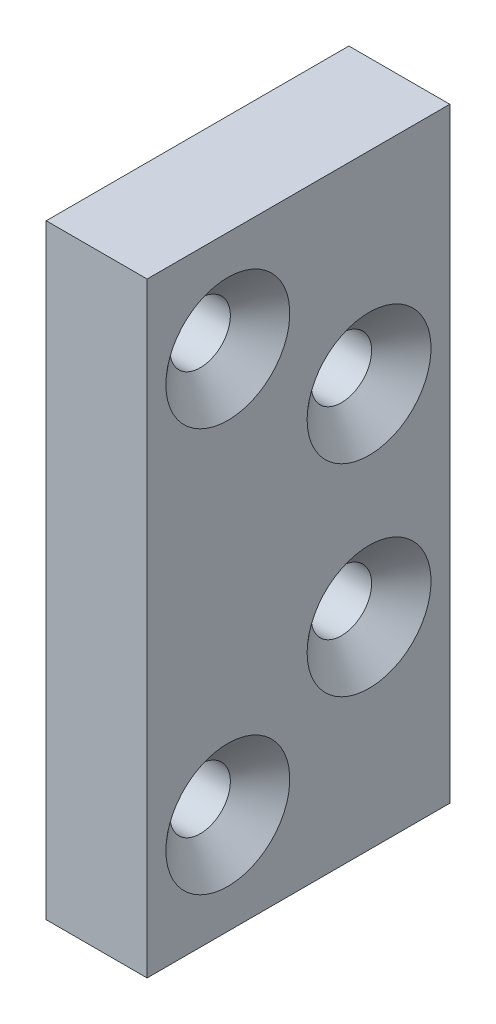
ISO-10303-21;
HEADER;
FILE_DESCRIPTION(('STEP AP214'),'2;1');
FILE_NAME('part.step','',(''),(''),'','','');
FILE_SCHEMA(('AUTOMOTIVE_DESIGN { 1 0 10303 214 1 1 1 1 }'));
ENDSEC;
DATA;
#1=APPLICATION_CONTEXT('core data for automotive mechanical design processes');
#2=APPLICATION_PROTOCOL_DEFINITION('international standard','automotive_design',2000,#1);
#3=PRODUCT_CONTEXT('',#1,'mechanical');
#4=PRODUCT('Part','Part','',(#3));
#5=PRODUCT_RELATED_PRODUCT_CATEGORY('part','',(#4));
#6=PRODUCT_DEFINITION_FORMATION('','',#4);
#7=PRODUCT_DEFINITION_CONTEXT('part definition',#1,'design');
#8=PRODUCT_DEFINITION('design','',#6,#7);
#9=PRODUCT_DEFINITION_SHAPE('','',#8);
#10=(LENGTH_UNIT() NAMED_UNIT(*) SI_UNIT(.MILLI.,.METRE.));
#11=(NAMED_UNIT(*) PLANE_ANGLE_UNIT() SI_UNIT($,.RADIAN.));
#12=(NAMED_UNIT(*) SI_UNIT($,.STERADIAN.) SOLID_ANGLE_UNIT());
#13=UNCERTAINTY_MEASURE_WITH_UNIT(LENGTH_MEASURE(1.E-05),#10,'distance_accuracy_value','');
#14=(GEOMETRIC_REPRESENTATION_CONTEXT(3) GLOBAL_UNCERTAINTY_ASSIGNED_CONTEXT((#13)) GLOBAL_UNIT_ASSIGNED_CONTEXT((#10,
#11,#12)) REPRESENTATION_CONTEXT('',''));
#15=CARTESIAN_POINT('',(0.,0.,0.));
#16=DIRECTION('',(0.,0.,1.));
#17=DIRECTION('',(1.,0.,0.));
#18=AXIS2_PLACEMENT_3D('',#15,#16,#17);
#19=CARTESIAN_POINT('',(6.35,19.05,-9.52499999999999));
#20=DIRECTION('',(-1.,0.,0.));
#21=DIRECTION('',(0.,0.,1.));
#22=AXIS2_PLACEMENT_3D('',#19,#20,#21);
#23=PLANE('',#22);
#24=CARTESIAN_POINT('',(6.35,-6.35,-4.445));
#25=DIRECTION('',(-1.,0.,0.));
#26=DIRECTION('',(0.,0.,1.));
#27=AXIS2_PLACEMENT_3D('',#24,#25,#26);
#28=CIRCLE('',#27,3.89890000000001);
#29=CARTESIAN_POINT('',(6.35,-6.35,-0.546099999999985));
#30=VERTEX_POINT('',#29);
#31=EDGE_CURVE('E121',#30,#30,#28,.T.);
#32=ORIENTED_EDGE('',*,*,#31,.T.);
#33=EDGE_LOOP('',(#32));
#34=FACE_BOUND('',#33,.T.);
#35=CARTESIAN_POINT('',(6.35,-12.7,4.44500000000001));
#36=DIRECTION('',(-1.,0.,0.));
#37=DIRECTION('',(0.,0.,1.));
#38=AXIS2_PLACEMENT_3D('',#35,#36,#37);
#39=CIRCLE('',#38,3.89890000000001);
#40=CARTESIAN_POINT('',(6.35,-12.7,8.34390000000002));
#41=VERTEX_POINT('',#40);
#42=EDGE_CURVE('E118',#41,#41,#39,.T.);
#43=ORIENTED_EDGE('',*,*,#42,.T.);
#44=EDGE_LOOP('',(#43));
#45=FACE_BOUND('',#44,.T.);
#46=CARTESIAN_POINT('',(6.35,6.35,-4.445));
#47=DIRECTION('',(-1.,0.,0.));
#48=DIRECTION('',(0.,0.,1.));
#49=AXIS2_PLACEMENT_3D('',#46,#47,#48);
#50=CIRCLE('',#49,3.89890000000002);
#51=CARTESIAN_POINT('',(6.35,6.35,-0.546099999999978));
#52=VERTEX_POINT('',#51);
#53=EDGE_CURVE('E115',#52,#52,#50,.T.);
#54=ORIENTED_EDGE('',*,*,#53,.T.);
#55=EDGE_LOOP('',(#54));
#56=FACE_BOUND('',#55,.T.);
#57=CARTESIAN_POINT('',(6.35,12.7,4.44500000000001));
#58=DIRECTION('',(-1.,0.,0.));
#59=DIRECTION('',(0.,0.,1.));
#60=AXIS2_PLACEMENT_3D('',#57,#58,#59);
#61=CIRCLE('',#60,3.89890000000002);
#62=CARTESIAN_POINT('',(6.35,12.7,8.34390000000002));
#63=VERTEX_POINT('',#62);
#64=EDGE_CURVE('E112',#63,#63,#61,.T.);
#65=ORIENTED_EDGE('',*,*,#64,.T.);
#66=EDGE_LOOP('',(#65));
#67=FACE_BOUND('',#66,.T.);
#68=DIRECTION('',(0.,1.,0.));
#69=VECTOR('',#68,1.);
#70=CARTESIAN_POINT('',(6.35,-19.05,-9.525));
#71=LINE('',#70,#69);
#72=CARTESIAN_POINT('',(6.35,-19.05,-9.525));
#73=VERTEX_POINT('',#72);
#74=CARTESIAN_POINT('',(6.35,19.05,-9.525));
#75=VERTEX_POINT('',#74);
#76=EDGE_CURVE('E84',#73,#75,#71,.T.);
#77=ORIENTED_EDGE('',*,*,#76,.T.);
#78=DIRECTION('',(0.,0.,1.));
#79=VECTOR('',#78,1.);
#80=CARTESIAN_POINT('',(6.35,19.05,9.525));
#81=LINE('',#80,#79);
#82=CARTESIAN_POINT('',(6.35,19.05,9.525));
#83=VERTEX_POINT('',#82);
#84=EDGE_CURVE('E80',#75,#83,#81,.T.);
#85=ORIENTED_EDGE('',*,*,#84,.T.);
#86=DIRECTION('',(0.,-1.,0.));
#87=VECTOR('',#86,1.);
#88=CARTESIAN_POINT('',(6.35,-19.05,9.525));
#89=LINE('',#88,#87);
#90=CARTESIAN_POINT('',(6.35,-19.05,9.525));
#91=VERTEX_POINT('',#90);
#92=EDGE_CURVE('E82',#83,#91,#89,.T.);
#93=ORIENTED_EDGE('',*,*,#92,.T.);
#94=DIRECTION('',(0.,0.,-1.));
#95=VECTOR('',#94,1.);
#96=CARTESIAN_POINT('',(6.35,-19.05,9.525));
#97=LINE('',#96,#95);
#98=EDGE_CURVE('E49',#91,#73,#97,.T.);
#99=ORIENTED_EDGE('',*,*,#98,.T.);
#100=EDGE_LOOP('',(#77,#85,#93,#99));
#101=FACE_BOUND('',#100,.T.);
#102=ADVANCED_FACE('F32',(#34,#45,#56,#67,#101),#23,.F.);
#103=CARTESIAN_POINT('',(0.,19.05,-9.52499999999999));
#104=DIRECTION('',(-1.,0.,0.));
#105=DIRECTION('',(0.,0.,1.));
#106=AXIS2_PLACEMENT_3D('',#103,#104,#105);
#107=PLANE('',#106);
#108=CARTESIAN_POINT('',(0.,-12.7,4.44500000000001));
#109=DIRECTION('',(1.,0.,0.));
#110=DIRECTION('',(0.,0.,1.));
#111=AXIS2_PLACEMENT_3D('',#108,#109,#110);
#112=CIRCLE('',#111,1.89865);
#113=CARTESIAN_POINT('',(0.,-12.7,6.34365000000001));
#114=VERTEX_POINT('',#113);
#115=EDGE_CURVE('E187',#114,#114,#112,.T.);
#116=ORIENTED_EDGE('',*,*,#115,.T.);
#117=EDGE_LOOP('',(#116));
#118=FACE_BOUND('',#117,.T.);
#119=CARTESIAN_POINT('',(0.,12.7,4.44500000000001));
#120=DIRECTION('',(1.,0.,0.));
#121=DIRECTION('',(0.,0.,-1.));
#122=AXIS2_PLACEMENT_3D('',#119,#120,#121);
#123=CIRCLE('',#122,1.89865);
#124=CARTESIAN_POINT('',(0.,12.7,2.54635000000001));
#125=VERTEX_POINT('',#124);
#126=EDGE_CURVE('E102',#125,#125,#123,.T.);
#127=ORIENTED_EDGE('',*,*,#126,.T.);
#128=EDGE_LOOP('',(#127));
#129=FACE_BOUND('',#128,.T.);
#130=DIRECTION('',(0.,1.,0.));
#131=VECTOR('',#130,1.);
#132=CARTESIAN_POINT('',(0.,-19.05,-9.525));
#133=LINE('',#132,#131);
#134=CARTESIAN_POINT('',(0.,-19.05,-9.525));
#135=VERTEX_POINT('',#134);
#136=CARTESIAN_POINT('',(0.,19.05,-9.525));
#137=VERTEX_POINT('',#136);
#138=EDGE_CURVE('E99',#135,#137,#133,.T.);
#139=ORIENTED_EDGE('',*,*,#138,.F.);
#140=DIRECTION('',(0.,0.,-1.));
#141=VECTOR('',#140,1.);
#142=CARTESIAN_POINT('',(0.,-19.05,9.525));
#143=LINE('',#142,#141);
#144=CARTESIAN_POINT('',(0.,-19.05,9.525));
#145=VERTEX_POINT('',#144);
#146=EDGE_CURVE('E72',#145,#135,#143,.T.);
#147=ORIENTED_EDGE('',*,*,#146,.F.);
#148=DIRECTION('',(0.,-1.,0.));
#149=VECTOR('',#148,1.);
#150=CARTESIAN_POINT('',(0.,-19.05,9.525));
#151=LINE('',#150,#149);
#152=CARTESIAN_POINT('',(0.,19.05,9.525));
#153=VERTEX_POINT('',#152);
#154=EDGE_CURVE('E66',#153,#145,#151,.T.);
#155=ORIENTED_EDGE('',*,*,#154,.F.);
#156=DIRECTION('',(0.,0.,1.));
#157=VECTOR('',#156,1.);
#158=CARTESIAN_POINT('',(0.,19.05,9.525));
#159=LINE('',#158,#157);
#160=EDGE_CURVE('E89',#137,#153,#159,.T.);
#161=ORIENTED_EDGE('',*,*,#160,.F.);
#162=EDGE_LOOP('',(#139,#147,#155,#161));
#163=FACE_BOUND('',#162,.T.);
#164=CARTESIAN_POINT('',(0.,6.35,-4.445));
#165=DIRECTION('',(1.,0.,0.));
#166=DIRECTION('',(0.,0.,-1.));
#167=AXIS2_PLACEMENT_3D('',#164,#165,#166);
#168=CIRCLE('',#167,1.89865);
#169=CARTESIAN_POINT('',(0.,6.35,-6.34364999999999));
#170=VERTEX_POINT('',#169);
#171=EDGE_CURVE('E190',#170,#170,#168,.T.);
#172=ORIENTED_EDGE('',*,*,#171,.T.);
#173=EDGE_LOOP('',(#172));
#174=FACE_BOUND('',#173,.T.);
#175=CARTESIAN_POINT('',(0.,-6.35,-4.445));
#176=DIRECTION('',(1.,0.,0.));
#177=DIRECTION('',(0.,0.,1.));
#178=AXIS2_PLACEMENT_3D('',#175,#176,#177);
#179=CIRCLE('',#178,1.89865);
#180=CARTESIAN_POINT('',(0.,-6.35,-2.54635));
#181=VERTEX_POINT('',#180);
#182=EDGE_CURVE('E185',#181,#181,#179,.T.);
#183=ORIENTED_EDGE('',*,*,#182,.T.);
#184=EDGE_LOOP('',(#183));
#185=FACE_BOUND('',#184,.T.);
#186=ADVANCED_FACE('F146',(#118,#129,#163,#174,#185),#107,.T.);
#187=CARTESIAN_POINT('',(6.35,-19.05,-9.525));
#188=DIRECTION('',(0.,0.,1.));
#189=DIRECTION('',(1.,0.,0.));
#190=AXIS2_PLACEMENT_3D('',#187,#188,#189);
#191=PLANE('',#190);
#192=ORIENTED_EDGE('',*,*,#138,.T.);
#193=DIRECTION('',(-1.,0.,0.));
#194=VECTOR('',#193,1.);
#195=CARTESIAN_POINT('',(6.35,19.05,-9.525));
#196=LINE('',#195,#194);
#197=EDGE_CURVE('E90',#75,#137,#196,.T.);
#198=ORIENTED_EDGE('',*,*,#197,.F.);
#199=ORIENTED_EDGE('',*,*,#76,.F.);
#200=DIRECTION('',(-1.,0.,0.));
#201=VECTOR('',#200,1.);
#202=CARTESIAN_POINT('',(6.35,-19.05,-9.525));
#203=LINE('',#202,#201);
#204=EDGE_CURVE('E95',#73,#135,#203,.T.);
#205=ORIENTED_EDGE('',*,*,#204,.T.);
#206=EDGE_LOOP('',(#192,#198,#199,#205));
#207=FACE_BOUND('',#206,.T.);
#208=ADVANCED_FACE('F152',(#207),#191,.F.);
#209=CARTESIAN_POINT('',(6.35,19.05,9.525));
#210=DIRECTION('',(0.,-1.,0.));
#211=DIRECTION('',(0.,0.,-1.));
#212=AXIS2_PLACEMENT_3D('',#209,#210,#211);
#213=PLANE('',#212);
#214=ORIENTED_EDGE('',*,*,#160,.T.);
#215=DIRECTION('',(-1.,0.,0.));
#216=VECTOR('',#215,1.);
#217=CARTESIAN_POINT('',(6.35,19.05,9.525));
#218=LINE('',#217,#216);
#219=EDGE_CURVE('E87',#83,#153,#218,.T.);
#220=ORIENTED_EDGE('',*,*,#219,.F.);
#221=ORIENTED_EDGE('',*,*,#84,.F.);
#222=ORIENTED_EDGE('',*,*,#197,.T.);
#223=EDGE_LOOP('',(#214,#220,#221,#222));
#224=FACE_BOUND('',#223,.T.);
#225=ADVANCED_FACE('F88',(#224),#213,.F.);
#226=CARTESIAN_POINT('',(6.35,-19.05,9.525));
#227=DIRECTION('',(0.,0.,-1.));
#228=DIRECTION('',(-1.,0.,0.));
#229=AXIS2_PLACEMENT_3D('',#226,#227,#228);
#230=PLANE('',#229);
#231=ORIENTED_EDGE('',*,*,#154,.T.);
#232=DIRECTION('',(-1.,0.,0.));
#233=VECTOR('',#232,1.);
#234=CARTESIAN_POINT('',(6.35,-19.05,9.525));
#235=LINE('',#234,#233);
#236=EDGE_CURVE('E91',#91,#145,#235,.T.);
#237=ORIENTED_EDGE('',*,*,#236,.F.);
#238=ORIENTED_EDGE('',*,*,#92,.F.);
#239=ORIENTED_EDGE('',*,*,#219,.T.);
#240=EDGE_LOOP('',(#231,#237,#238,#239));
#241=FACE_BOUND('',#240,.T.);
#242=ADVANCED_FACE('F93',(#241),#230,.F.);
#243=CARTESIAN_POINT('',(6.35,-19.05,9.525));
#244=DIRECTION('',(0.,1.,0.));
#245=DIRECTION('',(0.,0.,1.));
#246=AXIS2_PLACEMENT_3D('',#243,#244,#245);
#247=PLANE('',#246);
#248=ORIENTED_EDGE('',*,*,#146,.T.);
#249=ORIENTED_EDGE('',*,*,#204,.F.);
#250=ORIENTED_EDGE('',*,*,#98,.F.);
#251=ORIENTED_EDGE('',*,*,#236,.T.);
#252=EDGE_LOOP('',(#248,#249,#250,#251));
#253=FACE_BOUND('',#252,.T.);
#254=ADVANCED_FACE('F160',(#253),#247,.F.);
#255=CARTESIAN_POINT('',(6.35,12.7,4.44500000000001));
#256=DIRECTION('',(-1.,0.,0.));
#257=DIRECTION('',(0.,0.,1.));
#258=AXIS2_PLACEMENT_3D('',#255,#256,#257);
#259=CYLINDRICAL_SURFACE('',#258,1.89865);
#260=CARTESIAN_POINT('',(4.61120920268308,12.7,4.44500000000001));
#261=DIRECTION('',(-1.,0.,0.));
#262=DIRECTION('',(0.,0.,1.));
#263=AXIS2_PLACEMENT_3D('',#260,#261,#262);
#264=CIRCLE('',#263,1.89865);
#265=CARTESIAN_POINT('',(4.61120920268308,12.7,6.34365000000001));
#266=VERTEX_POINT('',#265);
#267=EDGE_CURVE('E11',#266,#266,#264,.F.);
#268=ORIENTED_EDGE('',*,*,#267,.T.);
#269=EDGE_LOOP('',(#268));
#270=FACE_BOUND('',#269,.T.);
#271=ORIENTED_EDGE('',*,*,#126,.F.);
#272=EDGE_LOOP('',(#271));
#273=FACE_BOUND('',#272,.T.);
#274=ADVANCED_FACE('F157',(#270,#273),#259,.F.);
#275=CARTESIAN_POINT('',(6.35,6.35,-4.445));
#276=DIRECTION('',(-1.,0.,0.));
#277=DIRECTION('',(0.,0.,1.));
#278=AXIS2_PLACEMENT_3D('',#275,#276,#277);
#279=CYLINDRICAL_SURFACE('',#278,1.89865);
#280=CARTESIAN_POINT('',(4.61120920268308,6.35,-4.445));
#281=DIRECTION('',(-1.,0.,0.));
#282=DIRECTION('',(0.,0.,1.));
#283=AXIS2_PLACEMENT_3D('',#280,#281,#282);
#284=CIRCLE('',#283,1.89865);
#285=CARTESIAN_POINT('',(4.61120920268308,6.35,-2.54635));
#286=VERTEX_POINT('',#285);
#287=EDGE_CURVE('E41',#286,#286,#284,.F.);
#288=ORIENTED_EDGE('',*,*,#287,.T.);
#289=EDGE_LOOP('',(#288));
#290=FACE_BOUND('',#289,.T.);
#291=ORIENTED_EDGE('',*,*,#171,.F.);
#292=EDGE_LOOP('',(#291));
#293=FACE_BOUND('',#292,.T.);
#294=ADVANCED_FACE('F129',(#290,#293),#279,.F.);
#295=CARTESIAN_POINT('',(6.35,-12.7,4.44500000000001));
#296=DIRECTION('',(-1.,0.,0.));
#297=DIRECTION('',(0.,0.,1.));
#298=AXIS2_PLACEMENT_3D('',#295,#296,#297);
#299=CYLINDRICAL_SURFACE('',#298,1.89865);
#300=CARTESIAN_POINT('',(4.61120920268309,-12.7,4.44500000000001));
#301=DIRECTION('',(-1.,0.,0.));
#302=DIRECTION('',(0.,0.,1.));
#303=AXIS2_PLACEMENT_3D('',#300,#301,#302);
#304=CIRCLE('',#303,1.89865);
#305=CARTESIAN_POINT('',(4.61120920268309,-12.7,6.34365000000001));
#306=VERTEX_POINT('',#305);
#307=EDGE_CURVE('E124',#306,#306,#304,.F.);
#308=ORIENTED_EDGE('',*,*,#307,.T.);
#309=EDGE_LOOP('',(#308));
#310=FACE_BOUND('',#309,.T.);
#311=ORIENTED_EDGE('',*,*,#115,.F.);
#312=EDGE_LOOP('',(#311));
#313=FACE_BOUND('',#312,.T.);
#314=ADVANCED_FACE('F176',(#310,#313),#299,.F.);
#315=CARTESIAN_POINT('',(6.35,-6.35,-4.445));
#316=DIRECTION('',(-1.,0.,0.));
#317=DIRECTION('',(0.,0.,1.));
#318=AXIS2_PLACEMENT_3D('',#315,#316,#317);
#319=CYLINDRICAL_SURFACE('',#318,1.89865);
#320=CARTESIAN_POINT('',(4.61120920268309,-6.35,-4.445));
#321=DIRECTION('',(-1.,0.,0.));
#322=DIRECTION('',(0.,0.,1.));
#323=AXIS2_PLACEMENT_3D('',#320,#321,#322);
#324=CIRCLE('',#323,1.89865);
#325=CARTESIAN_POINT('',(4.61120920268309,-6.35,-2.54635));
#326=VERTEX_POINT('',#325);
#327=EDGE_CURVE('E109',#326,#326,#324,.F.);
#328=ORIENTED_EDGE('',*,*,#327,.T.);
#329=EDGE_LOOP('',(#328));
#330=FACE_BOUND('',#329,.T.);
#331=ORIENTED_EDGE('',*,*,#182,.F.);
#332=EDGE_LOOP('',(#331));
#333=FACE_BOUND('',#332,.T.);
#334=ADVANCED_FACE('F171',(#330,#333),#319,.F.);
#335=CARTESIAN_POINT('',(4.61120920268309,-6.35,-4.445));
#336=DIRECTION('',(1.,0.,0.));
#337=DIRECTION('',(0.,0.,-1.));
#338=AXIS2_PLACEMENT_3D('',#335,#336,#337);
#339=CONICAL_SURFACE('',#338,1.89865,0.855211333477223);
#340=ORIENTED_EDGE('',*,*,#31,.F.);
#341=EDGE_LOOP('',(#340));
#342=FACE_BOUND('',#341,.T.);
#343=ORIENTED_EDGE('',*,*,#327,.F.);
#344=EDGE_LOOP('',(#343));
#345=FACE_BOUND('',#344,.T.);
#346=ADVANCED_FACE('F141',(#342,#345),#339,.F.);
#347=CARTESIAN_POINT('',(4.61120920268309,-12.7,4.44500000000001));
#348=DIRECTION('',(1.,0.,0.));
#349=DIRECTION('',(0.,0.,-1.));
#350=AXIS2_PLACEMENT_3D('',#347,#348,#349);
#351=CONICAL_SURFACE('',#350,1.89865,0.855211333477224);
#352=ORIENTED_EDGE('',*,*,#42,.F.);
#353=EDGE_LOOP('',(#352));
#354=FACE_BOUND('',#353,.T.);
#355=ORIENTED_EDGE('',*,*,#307,.F.);
#356=EDGE_LOOP('',(#355));
#357=FACE_BOUND('',#356,.T.);
#358=ADVANCED_FACE('F134',(#354,#357),#351,.F.);
#359=CARTESIAN_POINT('',(4.61120920268308,6.35,-4.445));
#360=DIRECTION('',(1.,0.,0.));
#361=DIRECTION('',(0.,0.,-1.));
#362=AXIS2_PLACEMENT_3D('',#359,#360,#361);
#363=CONICAL_SURFACE('',#362,1.89865,0.855211333477223);
#364=ORIENTED_EDGE('',*,*,#53,.F.);
#365=EDGE_LOOP('',(#364));
#366=FACE_BOUND('',#365,.T.);
#367=ORIENTED_EDGE('',*,*,#287,.F.);
#368=EDGE_LOOP('',(#367));
#369=FACE_BOUND('',#368,.T.);
#370=ADVANCED_FACE('F132',(#366,#369),#363,.F.);
#371=CARTESIAN_POINT('',(4.61120920268308,12.7,4.44500000000001));
#372=DIRECTION('',(1.,0.,0.));
#373=DIRECTION('',(0.,0.,-1.));
#374=AXIS2_PLACEMENT_3D('',#371,#372,#373);
#375=CONICAL_SURFACE('',#374,1.89865,0.855211333477223);
#376=ORIENTED_EDGE('',*,*,#64,.F.);
#377=EDGE_LOOP('',(#376));
#378=FACE_BOUND('',#377,.T.);
#379=ORIENTED_EDGE('',*,*,#267,.F.);
#380=EDGE_LOOP('',(#379));
#381=FACE_BOUND('',#380,.T.);
#382=ADVANCED_FACE('F34',(#378,#381),#375,.F.);
#383=CLOSED_SHELL('',(#102,#186,#208,#225,#242,#254,#274,#294,#314,#334,#346,#358,#370,#382));
#384=MANIFOLD_SOLID_BREP('B2',#383);
#385=ADVANCED_BREP_SHAPE_REPRESENTATION('',(#18,#384),#14);
#386=SHAPE_DEFINITION_REPRESENTATION(#9,#385);
ENDSEC;
END-ISO-10303-21;
